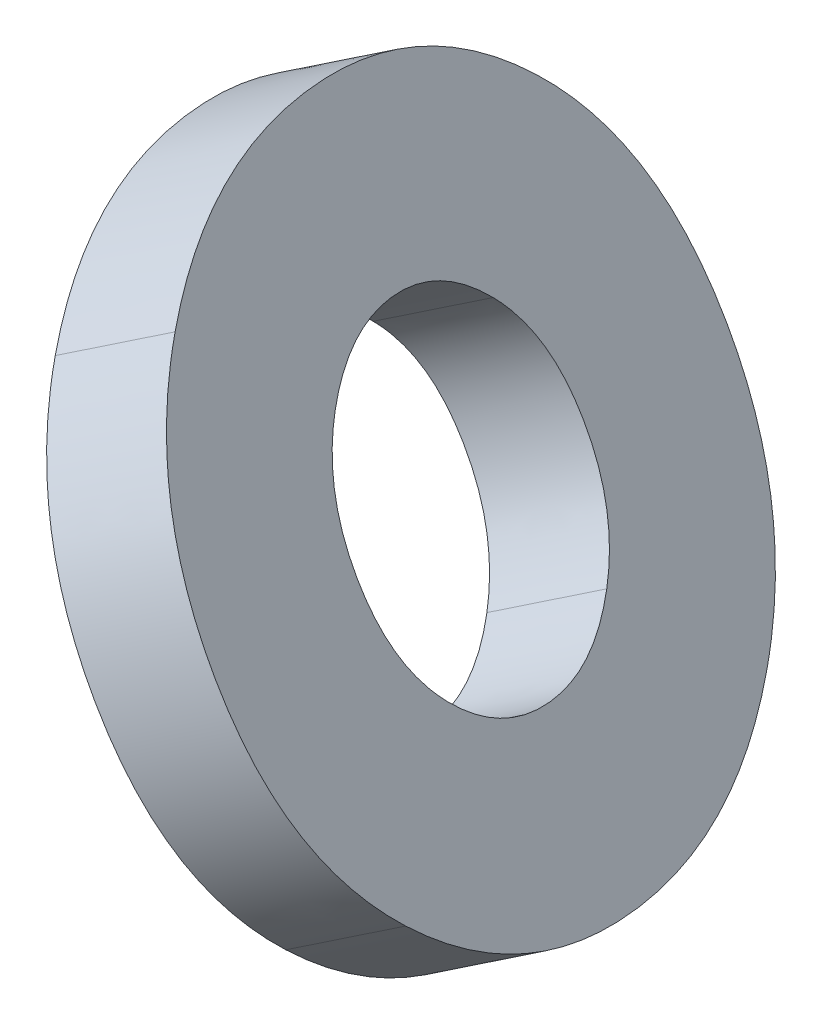
ISO-10303-21;
HEADER;
FILE_DESCRIPTION(('STEP AP214'),'2;1');
FILE_NAME('part.step','',(''),(''),'','','');
FILE_SCHEMA(('AUTOMOTIVE_DESIGN { 1 0 10303 214 1 1 1 1 }'));
ENDSEC;
DATA;
#1=APPLICATION_CONTEXT('core data for automotive mechanical design processes');
#2=APPLICATION_PROTOCOL_DEFINITION('international standard','automotive_design',2000,#1);
#3=PRODUCT_CONTEXT('',#1,'mechanical');
#4=PRODUCT('Part','Part','',(#3));
#5=PRODUCT_RELATED_PRODUCT_CATEGORY('part','',(#4));
#6=PRODUCT_DEFINITION_FORMATION('','',#4);
#7=PRODUCT_DEFINITION_CONTEXT('part definition',#1,'design');
#8=PRODUCT_DEFINITION('design','',#6,#7);
#9=PRODUCT_DEFINITION_SHAPE('','',#8);
#10=(LENGTH_UNIT() NAMED_UNIT(*) SI_UNIT(.MILLI.,.METRE.));
#11=(NAMED_UNIT(*) PLANE_ANGLE_UNIT() SI_UNIT($,.RADIAN.));
#12=(NAMED_UNIT(*) SI_UNIT($,.STERADIAN.) SOLID_ANGLE_UNIT());
#13=UNCERTAINTY_MEASURE_WITH_UNIT(LENGTH_MEASURE(1.E-05),#10,'distance_accuracy_value','');
#14=(GEOMETRIC_REPRESENTATION_CONTEXT(3) GLOBAL_UNCERTAINTY_ASSIGNED_CONTEXT((#13)) GLOBAL_UNIT_ASSIGNED_CONTEXT((#10,
#11,#12)) REPRESENTATION_CONTEXT('',''));
#15=CARTESIAN_POINT('',(0.,0.,0.));
#16=DIRECTION('',(0.,0.,1.));
#17=DIRECTION('',(1.,0.,0.));
#18=AXIS2_PLACEMENT_3D('',#15,#16,#17);
#19=CARTESIAN_POINT('',(6.94516848885329,3.9153529621467,-3.13891923668962));
#20=DIRECTION('',(0.840300748138486,0.485147863137997,-0.241921895599668));
#21=DIRECTION('',(0.,-0.446251135955039,-0.894907773828587));
#22=AXIS2_PLACEMENT_3D('',#19,#20,#21);
#23=PLANE('',#22);
#24=CARTESIAN_POINT('',(7.30141391778934,3.67666240244498,-2.38019053621221));
#25=CARTESIAN_POINT('',(7.23066210157928,3.75142890435418,-2.47600656559832));
#26=CARTESIAN_POINT('',(7.15618685100106,3.85653548036167,-2.52391201871226));
#27=CARTESIAN_POINT('',(6.9997666921069,4.12746314289435,-2.52391201871226));
#28=CARTESIAN_POINT('',(6.94612627679292,4.24459192814207,-2.47533973579859));
#29=CARTESIAN_POINT('',(6.917042199801,4.34341531050534,-2.37818201029336));
#30=B_SPLINE_CURVE_WITH_KNOTS('',3,(#24,#25,#26,#27,#28,#29),.UNSPECIFIED.,.F.,.F.,(4,2,4),(0.,
0.5,1.),.UNSPECIFIED.);
#31=CARTESIAN_POINT('',(7.30141391778934,3.67666240244498,-2.38019053621221));
#32=VERTEX_POINT('',#31);
#33=CARTESIAN_POINT('',(6.917042199801,4.34341531050534,-2.37818201029336));
#34=VERTEX_POINT('',#33);
#35=EDGE_CURVE('E19',#32,#34,#30,.T.);
#36=ORIENTED_EDGE('',*,*,#35,.T.);
#37=CARTESIAN_POINT('',(6.917042199801,4.34341531050534,-2.37818201029336));
#38=CARTESIAN_POINT('',(6.88793912801028,4.44226845726523,-2.28103057281019));
#39=CARTESIAN_POINT('',(6.88719134107729,4.49967481158663,-2.16850580880379));
#40=CARTESIAN_POINT('',(6.94352143342192,4.53219700556528,-1.90762701775115));
#41=CARTESIAN_POINT('',(6.99357360157773,4.5032565490151,-1.79181082168394));
#42=CARTESIAN_POINT('',(7.0649195019348,4.42879231069932,-1.69332512121229));
#43=B_SPLINE_CURVE_WITH_KNOTS('',3,(#37,#38,#39,#40,#41,#42),.UNSPECIFIED.,.F.,.F.,(4,2,4),(0.,
0.5,1.),.UNSPECIFIED.);
#44=CARTESIAN_POINT('',(7.0649195019348,4.42879231069932,-1.69332512121229));
#45=VERTEX_POINT('',#44);
#46=EDGE_CURVE('E192',#34,#45,#43,.T.);
#47=ORIENTED_EDGE('',*,*,#46,.T.);
#48=CARTESIAN_POINT('',(7.0649195019348,4.42879231069932,-1.69332512121229));
#49=CARTESIAN_POINT('',(7.13626155762249,4.35436658371147,-1.59477554471219));
#50=CARTESIAN_POINT('',(7.21102209035991,4.24943150394349,-1.54553526473129));
#51=CARTESIAN_POINT('',(7.36744224925407,3.9785038414108,-1.54553526473129));
#52=CARTESIAN_POINT('',(7.42108547805753,3.8613698920239,-1.59410813127871));
#53=CARTESIAN_POINT('',(7.45015859562141,3.76254018223185,-1.69131661264508));
#54=B_SPLINE_CURVE_WITH_KNOTS('',3,(#48,#49,#50,#51,#52,#53),.UNSPECIFIED.,.F.,.F.,(4,2,4),(0.,
0.5,1.),.UNSPECIFIED.);
#55=CARTESIAN_POINT('',(7.45015859562141,3.76254018223185,-1.69131661264508));
#56=VERTEX_POINT('',#55);
#57=EDGE_CURVE('E173',#45,#56,#54,.T.);
#58=ORIENTED_EDGE('',*,*,#57,.T.);
#59=CARTESIAN_POINT('',(7.45015859562141,3.76254018223185,-1.69131661264508));
#60=CARTESIAN_POINT('',(7.47927342545315,3.6636666699475,-1.78846805012825));
#61=CARTESIAN_POINT('',(7.47915170355881,3.60579224701134,-1.90495165962893));
#62=CARTESIAN_POINT('',(7.42166749281988,3.57260372246706,-2.17117546253771));
#63=CARTESIAN_POINT('',(7.37220769727077,3.60185224296043,-2.28431630048269));
#64=CARTESIAN_POINT('',(7.30141391778934,3.67666240244498,-2.38019053621221));
#65=B_SPLINE_CURVE_WITH_KNOTS('',3,(#59,#60,#61,#62,#63,#64),.UNSPECIFIED.,.F.,.F.,(4,2,4),(0.,
0.5,1.),.UNSPECIFIED.);
#66=EDGE_CURVE('E28',#56,#32,#65,.T.);
#67=ORIENTED_EDGE('',*,*,#66,.T.);
#68=EDGE_LOOP('',(#36,#47,#58,#67));
#69=FACE_BOUND('',#68,.T.);
#70=CARTESIAN_POINT('',(6.62317362593882,4.63237503135829,-2.81943926442245));
#71=CARTESIAN_POINT('',(6.678695329584,4.42998258496042,-3.03246394185604));
#72=CARTESIAN_POINT('',(6.7860498595503,4.1909545125302,-3.13891923668962));
#73=CARTESIAN_POINT('',(7.10569220405536,3.63731773159701,-3.13891923668962));
#74=CARTESIAN_POINT('',(7.25969246986149,3.42366601894758,-3.03246394185604));
#75=CARTESIAN_POINT('',(7.40722331570481,3.27436113302497,-2.81943926442245));
#76=B_SPLINE_CURVE_WITH_KNOTS('',3,(#70,#71,#72,#73,#74,#75),.UNSPECIFIED.,.F.,.F.,(4,2,4),(0.,
0.5,1.),.UNSPECIFIED.);
#77=CARTESIAN_POINT('',(6.62317362593882,4.63237503135829,-2.81943926442245));
#78=VERTEX_POINT('',#77);
#79=CARTESIAN_POINT('',(7.40722331570481,3.27436113302497,-2.81943926442245));
#80=VERTEX_POINT('',#79);
#81=EDGE_CURVE('E154',#78,#80,#76,.T.);
#82=ORIENTED_EDGE('',*,*,#81,.T.);
#83=CARTESIAN_POINT('',(7.40722331570481,3.27436113302497,-2.81943926442245));
#84=CARTESIAN_POINT('',(7.55471538879052,3.12509495821358,-2.60647163087207));
#85=CARTESIAN_POINT('',(7.66154825915051,3.0695034666457,-2.3468769075801));
#86=CARTESIAN_POINT('',(7.79490756554867,3.14649849809362,-1.72925649936344));
#87=CARTESIAN_POINT('',(7.8009022680068,3.26723101920005,-1.46631842412718));
#88=CARTESIAN_POINT('',(7.74566945862324,3.46976310474511,-1.25201025932153));
#89=B_SPLINE_CURVE_WITH_KNOTS('',3,(#83,#84,#85,#86,#87,#88),.UNSPECIFIED.,.F.,.F.,(4,2,4),(0.,
0.5,1.),.UNSPECIFIED.);
#90=CARTESIAN_POINT('',(7.74566945862324,3.46976310474511,-1.25201025932153));
#91=VERTEX_POINT('',#90);
#92=EDGE_CURVE('E126',#80,#91,#89,.T.);
#93=ORIENTED_EDGE('',*,*,#92,.T.);
#94=CARTESIAN_POINT('',(7.74566945862324,3.46976310474511,-1.25201025932153));
#95=CARTESIAN_POINT('',(7.69040896193087,3.67234030158825,-1.0377077989042));
#96=CARTESIAN_POINT('',(7.58253771211755,3.91262461403857,-0.930528046753937));
#97=CARTESIAN_POINT('',(7.2628953676125,4.46626139497176,-0.930528046753937));
#98=CARTESIAN_POINT('',(7.10941182165338,4.67865686760109,-1.0377077989042));
#99=CARTESIAN_POINT('',(6.96161976885724,4.82777700307844,-1.25201025932153));
#100=B_SPLINE_CURVE_WITH_KNOTS('',3,(#94,#95,#96,#97,#98,#99),.UNSPECIFIED.,.F.,.F.,(4,2,4),(0.,
0.5,1.),.UNSPECIFIED.);
#101=CARTESIAN_POINT('',(6.96161976885724,4.82777700307844,-1.25201025932153));
#102=VERTEX_POINT('',#101);
#103=EDGE_CURVE('E103',#91,#102,#100,.T.);
#104=ORIENTED_EDGE('',*,*,#103,.T.);
#105=CARTESIAN_POINT('',(6.96161976885724,4.82777700307844,-1.25201025932153));
#106=CARTESIAN_POINT('',(6.81381178679332,4.97692188432943,-1.46631842412718));
#107=CARTESIAN_POINT('',(6.70628346081535,5.03205075783591,-1.72925649936344));
#108=CARTESIAN_POINT('',(6.57292415441719,4.95505572638799,-2.3468769075801));
#109=CARTESIAN_POINT('',(6.56762490757704,4.83478582334295,-2.60647163087207));
#110=CARTESIAN_POINT('',(6.62317362593882,4.63237503135829,-2.81943926442245));
#111=B_SPLINE_CURVE_WITH_KNOTS('',3,(#105,#106,#107,#108,#109,#110),.UNSPECIFIED.,.F.,.F.,(4,2,
4),(0.,0.5,1.),.UNSPECIFIED.);
#112=EDGE_CURVE('E245',#102,#78,#111,.T.);
#113=ORIENTED_EDGE('',*,*,#112,.T.);
#114=EDGE_LOOP('',(#82,#93,#104,#113));
#115=FACE_BOUND('',#114,.T.);
#116=ADVANCED_FACE('F16',(#69,#115),#23,.F.);
#117=CARTESIAN_POINT('',(7.26166726145921,4.09808361370891,-3.2300389735141));
#118=DIRECTION('',(0.840300748138486,0.485147863137997,-0.241921895599668));
#119=DIRECTION('',(0.,-0.446251135955039,-0.894907773828587));
#120=AXIS2_PLACEMENT_3D('',#117,#118,#119);
#121=PLANE('',#120);
#122=CARTESIAN_POINT('',(7.61791269039525,3.85939305400719,-2.47131027303668));
#123=CARTESIAN_POINT('',(7.54716087418519,3.93415955591639,-2.5671263024228));
#124=CARTESIAN_POINT('',(7.47268562360698,4.03926613192388,-2.61503175553674));
#125=CARTESIAN_POINT('',(7.31626546471282,4.31019379445656,-2.61503175553674));
#126=CARTESIAN_POINT('',(7.26262504939883,4.42732257970428,-2.56645947262307));
#127=CARTESIAN_POINT('',(7.23354097240691,4.52614596206754,-2.46930174711783));
#128=B_SPLINE_CURVE_WITH_KNOTS('',3,(#122,#123,#124,#125,#126,#127),.UNSPECIFIED.,.F.,.F.,(4,2,
4),(0.,0.5,1.),.UNSPECIFIED.);
#129=CARTESIAN_POINT('',(7.61791269039525,3.85939305400719,-2.47131027303668));
#130=VERTEX_POINT('',#129);
#131=CARTESIAN_POINT('',(7.23354097240691,4.52614596206754,-2.46930174711784));
#132=VERTEX_POINT('',#131);
#133=EDGE_CURVE('E201',#130,#132,#128,.T.);
#134=ORIENTED_EDGE('',*,*,#133,.F.);
#135=CARTESIAN_POINT('',(7.76665736822732,3.94527083379405,-1.78243634946956));
#136=CARTESIAN_POINT('',(7.79577219805906,3.84639732150971,-1.87958778695273));
#137=CARTESIAN_POINT('',(7.79565047616474,3.78852289857355,-1.99607139645341));
#138=CARTESIAN_POINT('',(7.73816626542579,3.75533437402927,-2.26229519936218));
#139=CARTESIAN_POINT('',(7.68870646987669,3.78458289452264,-2.37543603730717));
#140=CARTESIAN_POINT('',(7.61791269039525,3.85939305400719,-2.47131027303668));
#141=B_SPLINE_CURVE_WITH_KNOTS('',3,(#135,#136,#137,#138,#139,#140),.UNSPECIFIED.,.F.,.F.,(4,2,
4),(0.,0.5,1.),.UNSPECIFIED.);
#142=CARTESIAN_POINT('',(7.76665736822732,3.94527083379406,-1.78243634946955));
#143=VERTEX_POINT('',#142);
#144=EDGE_CURVE('E11',#143,#130,#141,.T.);
#145=ORIENTED_EDGE('',*,*,#144,.F.);
#146=CARTESIAN_POINT('',(7.38141827454072,4.61152296226153,-1.78444485803677));
#147=CARTESIAN_POINT('',(7.4527603302284,4.53709723527368,-1.68589528153667));
#148=CARTESIAN_POINT('',(7.52752086296583,4.4321621555057,-1.63665500155577));
#149=CARTESIAN_POINT('',(7.68394102185998,4.16123449297301,-1.63665500155577));
#150=CARTESIAN_POINT('',(7.73758425066344,4.04410054358611,-1.68522786810319));
#151=CARTESIAN_POINT('',(7.76665736822732,3.94527083379405,-1.78243634946956));
#152=B_SPLINE_CURVE_WITH_KNOTS('',3,(#146,#147,#148,#149,#150,#151),.UNSPECIFIED.,.F.,.F.,(4,2,
4),(0.,0.5,1.),.UNSPECIFIED.);
#153=CARTESIAN_POINT('',(7.38141827454072,4.61152296226153,-1.78444485803677));
#154=VERTEX_POINT('',#153);
#155=EDGE_CURVE('E164',#154,#143,#152,.T.);
#156=ORIENTED_EDGE('',*,*,#155,.F.);
#157=CARTESIAN_POINT('',(7.23354097240691,4.52614596206754,-2.46930174711783));
#158=CARTESIAN_POINT('',(7.20443790061619,4.62499910882744,-2.37215030963467));
#159=CARTESIAN_POINT('',(7.2036901136832,4.68240546314884,-2.25962554562827));
#160=CARTESIAN_POINT('',(7.26002020602784,4.71492765712749,-1.99874675457563));
#161=CARTESIAN_POINT('',(7.31007237418364,4.68598720057731,-1.88293055850842));
#162=CARTESIAN_POINT('',(7.38141827454072,4.61152296226153,-1.78444485803677));
#163=B_SPLINE_CURVE_WITH_KNOTS('',3,(#157,#158,#159,#160,#161,#162),.UNSPECIFIED.,.F.,.F.,(4,2,
4),(0.,0.5,1.),.UNSPECIFIED.);
#164=EDGE_CURVE('E183',#132,#154,#163,.T.);
#165=ORIENTED_EDGE('',*,*,#164,.F.);
#166=EDGE_LOOP('',(#134,#145,#156,#165));
#167=FACE_BOUND('',#166,.T.);
#168=CARTESIAN_POINT('',(6.93967239854473,4.8151056829205,-2.91055900124693));
#169=CARTESIAN_POINT('',(6.9951941021899,4.61271323652262,-3.12358367868051));
#170=CARTESIAN_POINT('',(7.10254863215622,4.3736851640924,-3.2300389735141));
#171=CARTESIAN_POINT('',(7.42219097666127,3.82004838315921,-3.2300389735141));
#172=CARTESIAN_POINT('',(7.57619124246739,3.60639667050979,-3.12358367868051));
#173=CARTESIAN_POINT('',(7.72372208831072,3.45709178458718,-2.91055900124693));
#174=B_SPLINE_CURVE_WITH_KNOTS('',3,(#168,#169,#170,#171,#172,#173),.UNSPECIFIED.,.F.,.F.,(4,2,
4),(0.,0.5,1.),.UNSPECIFIED.);
#175=CARTESIAN_POINT('',(6.93967239854473,4.8151056829205,-2.91055900124693));
#176=VERTEX_POINT('',#175);
#177=CARTESIAN_POINT('',(7.72372208831072,3.45709178458718,-2.91055900124693));
#178=VERTEX_POINT('',#177);
#179=EDGE_CURVE('E145',#176,#178,#174,.T.);
#180=ORIENTED_EDGE('',*,*,#179,.F.);
#181=CARTESIAN_POINT('',(7.27811854146316,5.01050765464065,-1.343129996146));
#182=CARTESIAN_POINT('',(7.13031055939923,5.15965253589164,-1.55743816095165));
#183=CARTESIAN_POINT('',(7.02278223342127,5.21478140939812,-1.82037623618792));
#184=CARTESIAN_POINT('',(6.8894229270231,5.1377863779502,-2.43799664440458));
#185=CARTESIAN_POINT('',(6.88412368018295,5.01751647490516,-2.69759136769655));
#186=CARTESIAN_POINT('',(6.93967239854473,4.8151056829205,-2.91055900124693));
#187=B_SPLINE_CURVE_WITH_KNOTS('',3,(#181,#182,#183,#184,#185,#186),.UNSPECIFIED.,.F.,.F.,(4,2,
4),(0.,0.5,1.),.UNSPECIFIED.);
#188=CARTESIAN_POINT('',(7.27811854146316,5.01050765464065,-1.343129996146));
#189=VERTEX_POINT('',#188);
#190=EDGE_CURVE('E42',#189,#176,#187,.T.);
#191=ORIENTED_EDGE('',*,*,#190,.F.);
#192=CARTESIAN_POINT('',(8.06216823122915,3.65249375630732,-1.343129996146));
#193=CARTESIAN_POINT('',(8.00690773453678,3.85507095315046,-1.12882753572868));
#194=CARTESIAN_POINT('',(7.89903648472346,4.09535526560078,-1.02164778357842));
#195=CARTESIAN_POINT('',(7.57939414021841,4.64899204653397,-1.02164778357842));
#196=CARTESIAN_POINT('',(7.42591059425929,4.8613875191633,-1.12882753572868));
#197=CARTESIAN_POINT('',(7.27811854146316,5.01050765464065,-1.343129996146));
#198=B_SPLINE_CURVE_WITH_KNOTS('',3,(#192,#193,#194,#195,#196,#197),.UNSPECIFIED.,.F.,.F.,(4,2,
4),(0.,0.5,1.),.UNSPECIFIED.);
#199=CARTESIAN_POINT('',(8.06216823122915,3.65249375630732,-1.343129996146));
#200=VERTEX_POINT('',#199);
#201=EDGE_CURVE('E107',#200,#189,#198,.T.);
#202=ORIENTED_EDGE('',*,*,#201,.F.);
#203=CARTESIAN_POINT('',(7.72372208831072,3.45709178458718,-2.91055900124693));
#204=CARTESIAN_POINT('',(7.87121416139643,3.30782560977579,-2.69759136769655));
#205=CARTESIAN_POINT('',(7.97804703175642,3.2522341182079,-2.43799664440458));
#206=CARTESIAN_POINT('',(8.11140633815458,3.32922914965583,-1.82037623618792));
#207=CARTESIAN_POINT('',(8.11740104061272,3.44996167076226,-1.55743816095165));
#208=CARTESIAN_POINT('',(8.06216823122915,3.65249375630732,-1.343129996146));
#209=B_SPLINE_CURVE_WITH_KNOTS('',3,(#203,#204,#205,#206,#207,#208),.UNSPECIFIED.,.F.,.F.,(4,2,
4),(0.,0.5,1.),.UNSPECIFIED.);
#210=EDGE_CURVE('E110',#178,#200,#209,.T.);
#211=ORIENTED_EDGE('',*,*,#210,.F.);
#212=EDGE_LOOP('',(#180,#191,#202,#211));
#213=FACE_BOUND('',#212,.T.);
#214=ADVANCED_FACE('F108',(#167,#213),#121,.T.);
#215=CARTESIAN_POINT('',(7.59019421111824,3.84338978253508,-1.73163275139362));
#216=CARTESIAN_POINT('',(7.61930904094998,3.74451627025074,-1.82878418887679));
#217=CARTESIAN_POINT('',(7.61918731905565,3.68664184731457,-1.94526779837747));
#218=CARTESIAN_POINT('',(7.5617031083167,3.65345332277029,-2.21149160128625));
#219=CARTESIAN_POINT('',(7.5122433127676,3.68270184326366,-2.32463243923123));
#220=CARTESIAN_POINT('',(7.44144953328617,3.75751200274821,-2.42050667496075));
#221=(BOUNDED_CURVE() B_SPLINE_CURVE(3,(#215,#216,#217,#218,#219,#220),.UNSPECIFIED.,.F.,
.F.) B_SPLINE_CURVE_WITH_KNOTS((4,2,4),(0.,0.5,1.),
.UNSPECIFIED.) CURVE() GEOMETRIC_REPRESENTATION_ITEM() RATIONAL_B_SPLINE_CURVE((1.,1.,1.,1.,1.,1.)) REPRESENTATION_ITEM(''));
#222=DIRECTION('',(-0.840300748138486,-0.485147863137997,0.241921895599668));
#223=VECTOR('',#222,1.);
#224=SURFACE_OF_LINEAR_EXTRUSION('',#221,#223);
#225=ORIENTED_EDGE('',*,*,#66,.F.);
#226=DIRECTION('',(-0.840300748138486,-0.485147863137997,0.241921895599668));
#227=VECTOR('',#226,1.);
#228=CARTESIAN_POINT('',(7.59019421111824,3.84338978253508,-1.73163275139362));
#229=LINE('',#228,#227);
#230=EDGE_CURVE('E163',#143,#56,#229,.T.);
#231=ORIENTED_EDGE('',*,*,#230,.F.);
#232=ORIENTED_EDGE('',*,*,#144,.T.);
#233=DIRECTION('',(-0.840300748138486,-0.485147863137997,0.241921895599668));
#234=VECTOR('',#233,1.);
#235=CARTESIAN_POINT('',(7.44144953328617,3.75751200274821,-2.42050667496075));
#236=LINE('',#235,#234);
#237=EDGE_CURVE('E209',#130,#32,#236,.T.);
#238=ORIENTED_EDGE('',*,*,#237,.T.);
#239=EDGE_LOOP('',(#225,#231,#232,#238));
#240=FACE_BOUND('',#239,.T.);
#241=ADVANCED_FACE('F303',(#240),#224,.T.);
#242=CARTESIAN_POINT('',(7.10165538435407,4.90862660338167,-1.29232639807008));
#243=CARTESIAN_POINT('',(6.95384740229015,5.05777148463266,-1.50663456287572));
#244=CARTESIAN_POINT('',(6.84631907631218,5.11290035813914,-1.76957263811199));
#245=CARTESIAN_POINT('',(6.71295976991401,5.03590532669122,-2.38719304632865));
#246=CARTESIAN_POINT('',(6.70766052307386,4.91563542364618,-2.64678776962063));
#247=CARTESIAN_POINT('',(6.76320924143565,4.71322463166152,-2.859755403171));
#248=(BOUNDED_CURVE() B_SPLINE_CURVE(3,(#242,#243,#244,#245,#246,#247),.UNSPECIFIED.,.F.,
.F.) B_SPLINE_CURVE_WITH_KNOTS((4,2,4),(0.,0.5,1.),
.UNSPECIFIED.) CURVE() GEOMETRIC_REPRESENTATION_ITEM() RATIONAL_B_SPLINE_CURVE((1.,1.,1.,1.,1.,1.)) REPRESENTATION_ITEM(''));
#249=DIRECTION('',(-0.840300748138486,-0.485147863137997,0.241921895599668));
#250=VECTOR('',#249,1.);
#251=SURFACE_OF_LINEAR_EXTRUSION('',#248,#250);
#252=ORIENTED_EDGE('',*,*,#112,.F.);
#253=DIRECTION('',(-0.840300748138486,-0.485147863137997,0.241921895599668));
#254=VECTOR('',#253,1.);
#255=CARTESIAN_POINT('',(7.10165538435407,4.90862660338167,-1.29232639807008));
#256=LINE('',#255,#254);
#257=EDGE_CURVE('E113',#189,#102,#256,.T.);
#258=ORIENTED_EDGE('',*,*,#257,.F.);
#259=ORIENTED_EDGE('',*,*,#190,.T.);
#260=DIRECTION('',(-0.840300748138486,-0.485147863137997,0.241921895599668));
#261=VECTOR('',#260,1.);
#262=CARTESIAN_POINT('',(6.76320924143565,4.71322463166152,-2.859755403171));
#263=LINE('',#262,#261);
#264=EDGE_CURVE('E153',#176,#78,#263,.T.);
#265=ORIENTED_EDGE('',*,*,#264,.T.);
#266=EDGE_LOOP('',(#252,#258,#259,#265));
#267=FACE_BOUND('',#266,.T.);
#268=ADVANCED_FACE('F282',(#267),#251,.T.);
#269=CARTESIAN_POINT('',(7.88570507412007,3.55061270504834,-1.29232639807008));
#270=CARTESIAN_POINT('',(7.8304445774277,3.75318990189148,-1.07802393765275));
#271=CARTESIAN_POINT('',(7.72257332761438,3.9934742143418,-0.970844185502476));
#272=CARTESIAN_POINT('',(7.40293098310933,4.54711099527499,-0.970844185502476));
#273=CARTESIAN_POINT('',(7.24944743715021,4.75950646790432,-1.07802393765275));
#274=CARTESIAN_POINT('',(7.10165538435407,4.90862660338167,-1.29232639807008));
#275=(BOUNDED_CURVE() B_SPLINE_CURVE(3,(#269,#270,#271,#272,#273,#274),.UNSPECIFIED.,.F.,
.F.) B_SPLINE_CURVE_WITH_KNOTS((4,2,4),(0.,0.5,1.),
.UNSPECIFIED.) CURVE() GEOMETRIC_REPRESENTATION_ITEM() RATIONAL_B_SPLINE_CURVE((1.,1.,1.,1.,1.,1.)) REPRESENTATION_ITEM(''));
#276=DIRECTION('',(-0.840300748138486,-0.485147863137997,0.241921895599668));
#277=VECTOR('',#276,1.);
#278=SURFACE_OF_LINEAR_EXTRUSION('',#275,#277);
#279=ORIENTED_EDGE('',*,*,#103,.F.);
#280=DIRECTION('',(-0.840300748138486,-0.485147863137997,0.241921895599668));
#281=VECTOR('',#280,1.);
#282=CARTESIAN_POINT('',(7.88570507412007,3.55061270504834,-1.29232639807008));
#283=LINE('',#282,#281);
#284=EDGE_CURVE('E115',#200,#91,#283,.T.);
#285=ORIENTED_EDGE('',*,*,#284,.F.);
#286=ORIENTED_EDGE('',*,*,#201,.T.);
#287=ORIENTED_EDGE('',*,*,#257,.T.);
#288=EDGE_LOOP('',(#279,#285,#286,#287));
#289=FACE_BOUND('',#288,.T.);
#290=ADVANCED_FACE('F116',(#289),#278,.T.);
#291=CARTESIAN_POINT('',(7.54725893120164,3.3552107333282,-2.859755403171));
#292=CARTESIAN_POINT('',(7.69475100428734,3.2059445585168,-2.64678776962063));
#293=CARTESIAN_POINT('',(7.80158387464733,3.15035306694892,-2.38719304632865));
#294=CARTESIAN_POINT('',(7.9349431810455,3.22734809839685,-1.76957263811199));
#295=CARTESIAN_POINT('',(7.94093788350364,3.34808061950328,-1.50663456287572));
#296=CARTESIAN_POINT('',(7.88570507412007,3.55061270504834,-1.29232639807008));
#297=(BOUNDED_CURVE() B_SPLINE_CURVE(3,(#291,#292,#293,#294,#295,#296),.UNSPECIFIED.,.F.,
.F.) B_SPLINE_CURVE_WITH_KNOTS((4,2,4),(0.,0.5,1.),
.UNSPECIFIED.) CURVE() GEOMETRIC_REPRESENTATION_ITEM() RATIONAL_B_SPLINE_CURVE((1.,1.,1.,1.,1.,1.)) REPRESENTATION_ITEM(''));
#298=DIRECTION('',(-0.840300748138486,-0.485147863137997,0.241921895599668));
#299=VECTOR('',#298,1.);
#300=SURFACE_OF_LINEAR_EXTRUSION('',#297,#299);
#301=ORIENTED_EDGE('',*,*,#92,.F.);
#302=DIRECTION('',(-0.840300748138486,-0.485147863137997,0.241921895599668));
#303=VECTOR('',#302,1.);
#304=CARTESIAN_POINT('',(7.54725893120164,3.3552107333282,-2.859755403171));
#305=LINE('',#304,#303);
#306=EDGE_CURVE('E123',#178,#80,#305,.T.);
#307=ORIENTED_EDGE('',*,*,#306,.F.);
#308=ORIENTED_EDGE('',*,*,#210,.T.);
#309=ORIENTED_EDGE('',*,*,#284,.T.);
#310=EDGE_LOOP('',(#301,#307,#308,#309));
#311=FACE_BOUND('',#310,.T.);
#312=ADVANCED_FACE('F121',(#311),#300,.T.);
#313=CARTESIAN_POINT('',(6.76320924143565,4.71322463166152,-2.859755403171));
#314=CARTESIAN_POINT('',(6.81873094508082,4.51083218526364,-3.07278008060458));
#315=CARTESIAN_POINT('',(6.92608547504714,4.27180411283343,-3.17923537543817));
#316=CARTESIAN_POINT('',(7.24572781955219,3.71816733190024,-3.17923537543817));
#317=CARTESIAN_POINT('',(7.39972808535831,3.50451561925081,-3.07278008060458));
#318=CARTESIAN_POINT('',(7.54725893120164,3.3552107333282,-2.859755403171));
#319=(BOUNDED_CURVE() B_SPLINE_CURVE(3,(#313,#314,#315,#316,#317,#318),.UNSPECIFIED.,.F.,
.F.) B_SPLINE_CURVE_WITH_KNOTS((4,2,4),(0.,0.5,1.),
.UNSPECIFIED.) CURVE() GEOMETRIC_REPRESENTATION_ITEM() RATIONAL_B_SPLINE_CURVE((1.,1.,1.,1.,1.,1.)) REPRESENTATION_ITEM(''));
#320=DIRECTION('',(-0.840300748138486,-0.485147863137997,0.241921895599668));
#321=VECTOR('',#320,1.);
#322=SURFACE_OF_LINEAR_EXTRUSION('',#319,#321);
#323=ORIENTED_EDGE('',*,*,#81,.F.);
#324=ORIENTED_EDGE('',*,*,#264,.F.);
#325=ORIENTED_EDGE('',*,*,#179,.T.);
#326=ORIENTED_EDGE('',*,*,#306,.T.);
#327=EDGE_LOOP('',(#323,#324,#325,#326));
#328=FACE_BOUND('',#327,.T.);
#329=ADVANCED_FACE('F284',(#328),#322,.T.);
#330=CARTESIAN_POINT('',(7.20495511743163,4.50964191100255,-1.73364125996084));
#331=CARTESIAN_POINT('',(7.27629717311932,4.4352161840147,-1.63509168346074));
#332=CARTESIAN_POINT('',(7.35105770585673,4.33028110424671,-1.58585140347984));
#333=CARTESIAN_POINT('',(7.50747786475089,4.05935344171403,-1.58585140347984));
#334=CARTESIAN_POINT('',(7.56112109355436,3.94221949232713,-1.63442427002726));
#335=CARTESIAN_POINT('',(7.59019421111824,3.84338978253508,-1.73163275139362));
#336=(BOUNDED_CURVE() B_SPLINE_CURVE(3,(#330,#331,#332,#333,#334,#335),.UNSPECIFIED.,.F.,
.F.) B_SPLINE_CURVE_WITH_KNOTS((4,2,4),(0.,0.5,1.),
.UNSPECIFIED.) CURVE() GEOMETRIC_REPRESENTATION_ITEM() RATIONAL_B_SPLINE_CURVE((1.,1.,1.,1.,1.,1.)) REPRESENTATION_ITEM(''));
#337=DIRECTION('',(-0.840300748138486,-0.485147863137997,0.241921895599668));
#338=VECTOR('',#337,1.);
#339=SURFACE_OF_LINEAR_EXTRUSION('',#336,#338);
#340=ORIENTED_EDGE('',*,*,#57,.F.);
#341=DIRECTION('',(-0.840300748138486,-0.485147863137997,0.241921895599668));
#342=VECTOR('',#341,1.);
#343=CARTESIAN_POINT('',(7.20495511743163,4.50964191100255,-1.73364125996084));
#344=LINE('',#343,#342);
#345=EDGE_CURVE('E182',#154,#45,#344,.T.);
#346=ORIENTED_EDGE('',*,*,#345,.F.);
#347=ORIENTED_EDGE('',*,*,#155,.T.);
#348=ORIENTED_EDGE('',*,*,#230,.T.);
#349=EDGE_LOOP('',(#340,#346,#347,#348));
#350=FACE_BOUND('',#349,.T.);
#351=ADVANCED_FACE('F286',(#350),#339,.T.);
#352=CARTESIAN_POINT('',(7.05707781529782,4.42426491080856,-2.4184981490419));
#353=CARTESIAN_POINT('',(7.02797474350711,4.52311805756846,-2.32134671155874));
#354=CARTESIAN_POINT('',(7.02722695657412,4.58052441188986,-2.20882194755234));
#355=CARTESIAN_POINT('',(7.08355704891875,4.61304660586851,-1.9479431564997));
#356=CARTESIAN_POINT('',(7.13360921707456,4.58410614931833,-1.83212696043248));
#357=CARTESIAN_POINT('',(7.20495511743163,4.50964191100255,-1.73364125996084));
#358=(BOUNDED_CURVE() B_SPLINE_CURVE(3,(#352,#353,#354,#355,#356,#357),.UNSPECIFIED.,.F.,
.F.) B_SPLINE_CURVE_WITH_KNOTS((4,2,4),(0.,0.5,1.),
.UNSPECIFIED.) CURVE() GEOMETRIC_REPRESENTATION_ITEM() RATIONAL_B_SPLINE_CURVE((1.,1.,1.,1.,1.,1.)) REPRESENTATION_ITEM(''));
#359=DIRECTION('',(-0.840300748138486,-0.485147863137997,0.241921895599668));
#360=VECTOR('',#359,1.);
#361=SURFACE_OF_LINEAR_EXTRUSION('',#358,#360);
#362=ORIENTED_EDGE('',*,*,#46,.F.);
#363=DIRECTION('',(-0.840300748138486,-0.485147863137997,0.241921895599668));
#364=VECTOR('',#363,1.);
#365=CARTESIAN_POINT('',(7.05707781529782,4.42426491080856,-2.4184981490419));
#366=LINE('',#365,#364);
#367=EDGE_CURVE('E200',#132,#34,#366,.T.);
#368=ORIENTED_EDGE('',*,*,#367,.F.);
#369=ORIENTED_EDGE('',*,*,#164,.T.);
#370=ORIENTED_EDGE('',*,*,#345,.T.);
#371=EDGE_LOOP('',(#362,#368,#369,#370));
#372=FACE_BOUND('',#371,.T.);
#373=ADVANCED_FACE('F293',(#372),#361,.T.);
#374=CARTESIAN_POINT('',(7.44144953328617,3.75751200274821,-2.42050667496075));
#375=CARTESIAN_POINT('',(7.37069771707611,3.83227850465741,-2.51632270434686));
#376=CARTESIAN_POINT('',(7.29622246649789,3.9373850806649,-2.56422815746081));
#377=CARTESIAN_POINT('',(7.13980230760373,4.20831274319758,-2.56422815746081));
#378=CARTESIAN_POINT('',(7.08616189228975,4.3254415284453,-2.51565587454714));
#379=CARTESIAN_POINT('',(7.05707781529782,4.42426491080856,-2.4184981490419));
#380=(BOUNDED_CURVE() B_SPLINE_CURVE(3,(#374,#375,#376,#377,#378,#379),.UNSPECIFIED.,.F.,
.F.) B_SPLINE_CURVE_WITH_KNOTS((4,2,4),(0.,0.5,1.),
.UNSPECIFIED.) CURVE() GEOMETRIC_REPRESENTATION_ITEM() RATIONAL_B_SPLINE_CURVE((1.,1.,1.,1.,1.,1.)) REPRESENTATION_ITEM(''));
#381=DIRECTION('',(-0.840300748138486,-0.485147863137997,0.241921895599668));
#382=VECTOR('',#381,1.);
#383=SURFACE_OF_LINEAR_EXTRUSION('',#380,#382);
#384=ORIENTED_EDGE('',*,*,#35,.F.);
#385=ORIENTED_EDGE('',*,*,#237,.F.);
#386=ORIENTED_EDGE('',*,*,#133,.T.);
#387=ORIENTED_EDGE('',*,*,#367,.T.);
#388=EDGE_LOOP('',(#384,#385,#386,#387));
#389=FACE_BOUND('',#388,.T.);
#390=ADVANCED_FACE('F305',(#389),#383,.T.);
#391=CLOSED_SHELL('',(#116,#214,#241,#268,#290,#312,#329,#351,#373,#390));
#392=MANIFOLD_SOLID_BREP('B1',#391);
#393=ADVANCED_BREP_SHAPE_REPRESENTATION('',(#18,#392),#14);
#394=SHAPE_DEFINITION_REPRESENTATION(#9,#393);
ENDSEC;
END-ISO-10303-21;
